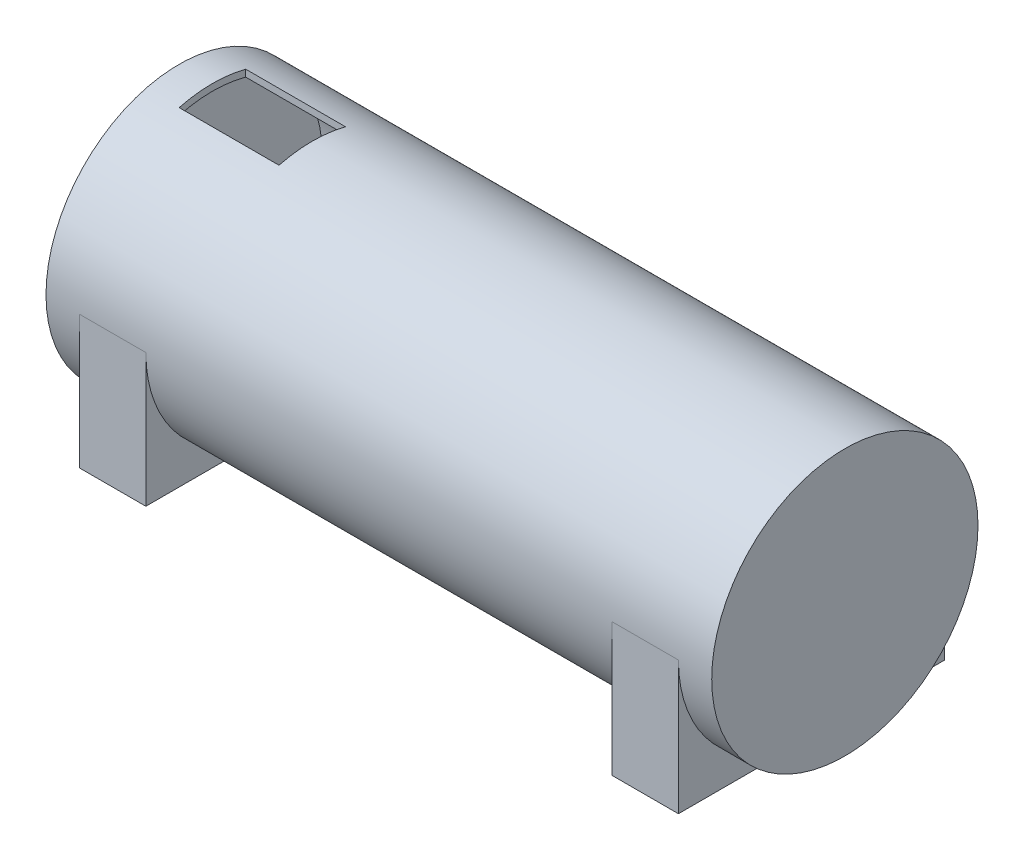
ISO-10303-21;
HEADER;
FILE_DESCRIPTION(('STEP AP214'),'2;1');
FILE_NAME('part.step','',(''),(''),'','','');
FILE_SCHEMA(('AUTOMOTIVE_DESIGN { 1 0 10303 214 1 1 1 1 }'));
ENDSEC;
DATA;
#1=APPLICATION_CONTEXT('core data for automotive mechanical design processes');
#2=APPLICATION_PROTOCOL_DEFINITION('international standard','automotive_design',2000,#1);
#3=PRODUCT_CONTEXT('',#1,'mechanical');
#4=PRODUCT('Part','Part','',(#3));
#5=PRODUCT_RELATED_PRODUCT_CATEGORY('part','',(#4));
#6=PRODUCT_DEFINITION_FORMATION('','',#4);
#7=PRODUCT_DEFINITION_CONTEXT('part definition',#1,'design');
#8=PRODUCT_DEFINITION('design','',#6,#7);
#9=PRODUCT_DEFINITION_SHAPE('','',#8);
#10=(LENGTH_UNIT() NAMED_UNIT(*) SI_UNIT(.MILLI.,.METRE.));
#11=(NAMED_UNIT(*) PLANE_ANGLE_UNIT() SI_UNIT($,.RADIAN.));
#12=(NAMED_UNIT(*) SI_UNIT($,.STERADIAN.) SOLID_ANGLE_UNIT());
#13=UNCERTAINTY_MEASURE_WITH_UNIT(LENGTH_MEASURE(1.E-05),#10,'distance_accuracy_value','');
#14=(GEOMETRIC_REPRESENTATION_CONTEXT(3) GLOBAL_UNCERTAINTY_ASSIGNED_CONTEXT((#13)) GLOBAL_UNIT_ASSIGNED_CONTEXT((#10,
#11,#12)) REPRESENTATION_CONTEXT('',''));
#15=CARTESIAN_POINT('',(0.,0.,0.));
#16=DIRECTION('',(0.,0.,1.));
#17=DIRECTION('',(1.,0.,0.));
#18=AXIS2_PLACEMENT_3D('',#15,#16,#17);
#19=CARTESIAN_POINT('',(-100.,0.,0.));
#20=DIRECTION('',(-1.,0.,0.));
#21=DIRECTION('',(0.,0.,1.));
#22=AXIS2_PLACEMENT_3D('',#19,#20,#21);
#23=PLANE('',#22);
#24=CARTESIAN_POINT('',(-100.,0.,0.));
#25=DIRECTION('',(1.,0.,0.));
#26=DIRECTION('',(0.,0.,-1.));
#27=AXIS2_PLACEMENT_3D('',#24,#25,#26);
#28=CIRCLE('',#27,40.);
#29=CARTESIAN_POINT('',(-100.,0.,-40.));
#30=VERTEX_POINT('',#29);
#31=EDGE_CURVE('E306',#30,#30,#28,.T.);
#32=ORIENTED_EDGE('',*,*,#31,.F.);
#33=EDGE_LOOP('',(#32));
#34=FACE_BOUND('',#33,.T.);
#35=ADVANCED_FACE('F47',(#34),#23,.T.);
#36=CARTESIAN_POINT('',(100.,0.,0.));
#37=DIRECTION('',(1.,0.,0.));
#38=DIRECTION('',(0.,0.,-1.));
#39=AXIS2_PLACEMENT_3D('',#36,#37,#38);
#40=CYLINDRICAL_SURFACE('',#39,40.);
#41=CARTESIAN_POINT('',(-90.,0.,0.));
#42=DIRECTION('',(1.,0.,0.));
#43=DIRECTION('',(0.,0.,-1.));
#44=AXIS2_PLACEMENT_3D('',#41,#42,#43);
#45=CIRCLE('',#44,40.);
#46=CARTESIAN_POINT('',(-90.,0.,40.));
#47=VERTEX_POINT('',#46);
#48=CARTESIAN_POINT('',(-90.,-40.,0.));
#49=VERTEX_POINT('',#48);
#50=EDGE_CURVE('E62',#47,#49,#45,.T.);
#51=ORIENTED_EDGE('',*,*,#50,.F.);
#52=DIRECTION('',(1.,0.,0.));
#53=VECTOR('',#52,1.);
#54=CARTESIAN_POINT('',(-90.,0.,40.));
#55=LINE('',#54,#53);
#56=CARTESIAN_POINT('',(-70.,0.,40.));
#57=VERTEX_POINT('',#56);
#58=EDGE_CURVE('E66',#47,#57,#55,.T.);
#59=ORIENTED_EDGE('',*,*,#58,.T.);
#60=CARTESIAN_POINT('',(-70.,0.,0.));
#61=DIRECTION('',(1.,0.,0.));
#62=DIRECTION('',(0.,0.,-1.));
#63=AXIS2_PLACEMENT_3D('',#60,#61,#62);
#64=CIRCLE('',#63,40.);
#65=CARTESIAN_POINT('',(-70.,-40.,0.));
#66=VERTEX_POINT('',#65);
#67=EDGE_CURVE('E175',#57,#66,#64,.T.);
#68=ORIENTED_EDGE('',*,*,#67,.T.);
#69=CARTESIAN_POINT('',(-70.,0.,0.));
#70=DIRECTION('',(-1.,0.,0.));
#71=DIRECTION('',(0.,0.,1.));
#72=AXIS2_PLACEMENT_3D('',#69,#70,#71);
#73=CIRCLE('',#72,40.);
#74=CARTESIAN_POINT('',(-70.,0.,-40.));
#75=VERTEX_POINT('',#74);
#76=EDGE_CURVE('E160',#75,#66,#73,.T.);
#77=ORIENTED_EDGE('',*,*,#76,.F.);
#78=DIRECTION('',(1.,0.,0.));
#79=VECTOR('',#78,1.);
#80=CARTESIAN_POINT('',(-90.,0.,-40.));
#81=LINE('',#80,#79);
#82=CARTESIAN_POINT('',(-90.,0.,-40.));
#83=VERTEX_POINT('',#82);
#84=EDGE_CURVE('E204',#83,#75,#81,.T.);
#85=ORIENTED_EDGE('',*,*,#84,.F.);
#86=CARTESIAN_POINT('',(-90.,0.,0.));
#87=DIRECTION('',(-1.,0.,0.));
#88=DIRECTION('',(0.,0.,1.));
#89=AXIS2_PLACEMENT_3D('',#86,#87,#88);
#90=CIRCLE('',#89,40.);
#91=EDGE_CURVE('E183',#83,#49,#90,.T.);
#92=ORIENTED_EDGE('',*,*,#91,.T.);
#93=EDGE_LOOP('',(#51,#59,#68,#77,#85,#92));
#94=FACE_BOUND('',#93,.T.);
#95=CARTESIAN_POINT('',(90.,0.,0.));
#96=DIRECTION('',(-1.,0.,0.));
#97=DIRECTION('',(0.,0.,1.));
#98=AXIS2_PLACEMENT_3D('',#95,#96,#97);
#99=CIRCLE('',#98,40.);
#100=CARTESIAN_POINT('',(90.,0.,-40.));
#101=VERTEX_POINT('',#100);
#102=CARTESIAN_POINT('',(90.,-40.,0.));
#103=VERTEX_POINT('',#102);
#104=EDGE_CURVE('E209',#101,#103,#99,.T.);
#105=ORIENTED_EDGE('',*,*,#104,.F.);
#106=DIRECTION('',(-1.,0.,0.));
#107=VECTOR('',#106,1.);
#108=CARTESIAN_POINT('',(90.,0.,-40.));
#109=LINE('',#108,#107);
#110=CARTESIAN_POINT('',(70.,0.,-40.));
#111=VERTEX_POINT('',#110);
#112=EDGE_CURVE('E222',#101,#111,#109,.T.);
#113=ORIENTED_EDGE('',*,*,#112,.T.);
#114=CARTESIAN_POINT('',(70.,0.,0.));
#115=DIRECTION('',(-1.,0.,0.));
#116=DIRECTION('',(0.,0.,1.));
#117=AXIS2_PLACEMENT_3D('',#114,#115,#116);
#118=CIRCLE('',#117,40.);
#119=CARTESIAN_POINT('',(70.,-40.,0.));
#120=VERTEX_POINT('',#119);
#121=EDGE_CURVE('E208',#111,#120,#118,.T.);
#122=ORIENTED_EDGE('',*,*,#121,.T.);
#123=CARTESIAN_POINT('',(70.,0.,0.));
#124=DIRECTION('',(1.,0.,0.));
#125=DIRECTION('',(0.,0.,-1.));
#126=AXIS2_PLACEMENT_3D('',#123,#124,#125);
#127=CIRCLE('',#126,40.);
#128=CARTESIAN_POINT('',(70.,0.,40.));
#129=VERTEX_POINT('',#128);
#130=EDGE_CURVE('E238',#129,#120,#127,.T.);
#131=ORIENTED_EDGE('',*,*,#130,.F.);
#132=DIRECTION('',(-1.,0.,0.));
#133=VECTOR('',#132,1.);
#134=CARTESIAN_POINT('',(90.,0.,40.));
#135=LINE('',#134,#133);
#136=CARTESIAN_POINT('',(90.,0.,40.));
#137=VERTEX_POINT('',#136);
#138=EDGE_CURVE('E262',#137,#129,#135,.T.);
#139=ORIENTED_EDGE('',*,*,#138,.F.);
#140=CARTESIAN_POINT('',(90.,0.,0.));
#141=DIRECTION('',(1.,0.,0.));
#142=DIRECTION('',(0.,0.,-1.));
#143=AXIS2_PLACEMENT_3D('',#140,#141,#142);
#144=CIRCLE('',#143,40.);
#145=EDGE_CURVE('E239',#137,#103,#144,.T.);
#146=ORIENTED_EDGE('',*,*,#145,.T.);
#147=EDGE_LOOP('',(#105,#113,#122,#131,#139,#146));
#148=FACE_BOUND('',#147,.T.);
#149=CARTESIAN_POINT('',(-90.,0.,0.));
#150=DIRECTION('',(-1.,0.,0.));
#151=DIRECTION('',(0.,0.,1.));
#152=AXIS2_PLACEMENT_3D('',#149,#150,#151);
#153=CIRCLE('',#152,40.);
#154=CARTESIAN_POINT('',(-90.,38.7298334620742,-10.));
#155=VERTEX_POINT('',#154);
#156=CARTESIAN_POINT('',(-90.,38.7298334620742,10.));
#157=VERTEX_POINT('',#156);
#158=EDGE_CURVE('E285',#155,#157,#153,.F.);
#159=ORIENTED_EDGE('',*,*,#158,.F.);
#160=DIRECTION('',(1.,0.,0.));
#161=VECTOR('',#160,1.);
#162=CARTESIAN_POINT('',(100.,38.7298334620742,-10.));
#163=LINE('',#162,#161);
#164=CARTESIAN_POINT('',(-60.,38.7298334620742,-10.));
#165=VERTEX_POINT('',#164);
#166=EDGE_CURVE('E271',#165,#155,#163,.F.);
#167=ORIENTED_EDGE('',*,*,#166,.F.);
#168=CARTESIAN_POINT('',(-60.,0.,0.));
#169=DIRECTION('',(1.,0.,0.));
#170=DIRECTION('',(0.,0.,-1.));
#171=AXIS2_PLACEMENT_3D('',#168,#169,#170);
#172=CIRCLE('',#171,40.);
#173=CARTESIAN_POINT('',(-60.,38.7298334620742,10.));
#174=VERTEX_POINT('',#173);
#175=EDGE_CURVE('E291',#174,#165,#172,.F.);
#176=ORIENTED_EDGE('',*,*,#175,.F.);
#177=DIRECTION('',(1.,0.,0.));
#178=VECTOR('',#177,1.);
#179=CARTESIAN_POINT('',(100.,38.7298334620742,10.));
#180=LINE('',#179,#178);
#181=EDGE_CURVE('E288',#157,#174,#180,.T.);
#182=ORIENTED_EDGE('',*,*,#181,.F.);
#183=EDGE_LOOP('',(#159,#167,#176,#182));
#184=FACE_BOUND('',#183,.T.);
#185=ORIENTED_EDGE('',*,*,#31,.T.);
#186=EDGE_LOOP('',(#185));
#187=FACE_BOUND('',#186,.T.);
#188=CARTESIAN_POINT('',(100.,0.,0.));
#189=DIRECTION('',(1.,0.,0.));
#190=DIRECTION('',(0.,0.,-1.));
#191=AXIS2_PLACEMENT_3D('',#188,#189,#190);
#192=CIRCLE('',#191,40.);
#193=CARTESIAN_POINT('',(100.,0.,-40.));
#194=VERTEX_POINT('',#193);
#195=EDGE_CURVE('E299',#194,#194,#192,.T.);
#196=ORIENTED_EDGE('',*,*,#195,.F.);
#197=EDGE_LOOP('',(#196));
#198=FACE_BOUND('',#197,.T.);
#199=ADVANCED_FACE('F340',(#94,#148,#184,#187,#198),#40,.T.);
#200=CARTESIAN_POINT('',(100.,40.,0.));
#201=DIRECTION('',(1.,0.,0.));
#202=DIRECTION('',(0.,0.,-1.));
#203=AXIS2_PLACEMENT_3D('',#200,#201,#202);
#204=PLANE('',#203);
#205=ORIENTED_EDGE('',*,*,#195,.T.);
#206=EDGE_LOOP('',(#205));
#207=FACE_BOUND('',#206,.T.);
#208=ADVANCED_FACE('F343',(#207),#204,.T.);
#209=CARTESIAN_POINT('',(-60.,30.,-10.));
#210=DIRECTION('',(1.,0.,0.));
#211=DIRECTION('',(0.,0.,-1.));
#212=AXIS2_PLACEMENT_3D('',#209,#210,#211);
#213=PLANE('',#212);
#214=ORIENTED_EDGE('',*,*,#175,.T.);
#215=DIRECTION('',(0.,1.,0.));
#216=VECTOR('',#215,1.);
#217=CARTESIAN_POINT('',(-60.,30.,-10.));
#218=LINE('',#217,#216);
#219=CARTESIAN_POINT('',(-60.,36.6606055596467,-10.));
#220=VERTEX_POINT('',#219);
#221=EDGE_CURVE('E266',#220,#165,#218,.T.);
#222=ORIENTED_EDGE('',*,*,#221,.F.);
#223=CARTESIAN_POINT('',(-60.,0.,0.));
#224=DIRECTION('',(1.,0.,0.));
#225=DIRECTION('',(0.,0.,-1.));
#226=AXIS2_PLACEMENT_3D('',#223,#224,#225);
#227=CIRCLE('',#226,38.);
#228=CARTESIAN_POINT('',(-60.,36.6606055596467,10.));
#229=VERTEX_POINT('',#228);
#230=EDGE_CURVE('E11',#220,#229,#227,.T.);
#231=ORIENTED_EDGE('',*,*,#230,.T.);
#232=DIRECTION('',(0.,1.,0.));
#233=VECTOR('',#232,1.);
#234=CARTESIAN_POINT('',(-60.,30.,10.));
#235=LINE('',#234,#233);
#236=EDGE_CURVE('E267',#229,#174,#235,.T.);
#237=ORIENTED_EDGE('',*,*,#236,.T.);
#238=EDGE_LOOP('',(#214,#222,#231,#237));
#239=FACE_BOUND('',#238,.T.);
#240=ADVANCED_FACE('F337',(#239),#213,.F.);
#241=CARTESIAN_POINT('',(-90.,30.,10.));
#242=DIRECTION('',(0.,0.,1.));
#243=DIRECTION('',(1.,0.,0.));
#244=AXIS2_PLACEMENT_3D('',#241,#242,#243);
#245=PLANE('',#244);
#246=ORIENTED_EDGE('',*,*,#181,.T.);
#247=ORIENTED_EDGE('',*,*,#236,.F.);
#248=DIRECTION('',(-1.,0.,0.));
#249=VECTOR('',#248,1.);
#250=CARTESIAN_POINT('',(95.,36.6606055596467,10.));
#251=LINE('',#250,#249);
#252=CARTESIAN_POINT('',(-90.,36.6606055596467,10.));
#253=VERTEX_POINT('',#252);
#254=EDGE_CURVE('E55',#229,#253,#251,.T.);
#255=ORIENTED_EDGE('',*,*,#254,.T.);
#256=DIRECTION('',(0.,1.,0.));
#257=VECTOR('',#256,1.);
#258=CARTESIAN_POINT('',(-90.,30.,10.));
#259=LINE('',#258,#257);
#260=EDGE_CURVE('E272',#253,#157,#259,.T.);
#261=ORIENTED_EDGE('',*,*,#260,.T.);
#262=EDGE_LOOP('',(#246,#247,#255,#261));
#263=FACE_BOUND('',#262,.T.);
#264=ADVANCED_FACE('F321',(#263),#245,.F.);
#265=CARTESIAN_POINT('',(-90.,30.,-10.));
#266=DIRECTION('',(-1.,0.,0.));
#267=DIRECTION('',(0.,0.,1.));
#268=AXIS2_PLACEMENT_3D('',#265,#266,#267);
#269=PLANE('',#268);
#270=ORIENTED_EDGE('',*,*,#158,.T.);
#271=ORIENTED_EDGE('',*,*,#260,.F.);
#272=CARTESIAN_POINT('',(-90.,0.,0.));
#273=DIRECTION('',(-1.,0.,0.));
#274=DIRECTION('',(0.,0.,1.));
#275=AXIS2_PLACEMENT_3D('',#272,#273,#274);
#276=CIRCLE('',#275,38.);
#277=CARTESIAN_POINT('',(-90.,36.6606055596467,-10.));
#278=VERTEX_POINT('',#277);
#279=EDGE_CURVE('E313',#253,#278,#276,.T.);
#280=ORIENTED_EDGE('',*,*,#279,.T.);
#281=DIRECTION('',(0.,1.,0.));
#282=VECTOR('',#281,1.);
#283=CARTESIAN_POINT('',(-90.,30.,-10.));
#284=LINE('',#283,#282);
#285=EDGE_CURVE('E276',#278,#155,#284,.T.);
#286=ORIENTED_EDGE('',*,*,#285,.T.);
#287=EDGE_LOOP('',(#270,#271,#280,#286));
#288=FACE_BOUND('',#287,.T.);
#289=ADVANCED_FACE('F327',(#288),#269,.F.);
#290=CARTESIAN_POINT('',(-90.,30.,-10.));
#291=DIRECTION('',(0.,0.,-1.));
#292=DIRECTION('',(-1.,0.,0.));
#293=AXIS2_PLACEMENT_3D('',#290,#291,#292);
#294=PLANE('',#293);
#295=ORIENTED_EDGE('',*,*,#166,.T.);
#296=ORIENTED_EDGE('',*,*,#285,.F.);
#297=DIRECTION('',(-1.,0.,0.));
#298=VECTOR('',#297,1.);
#299=CARTESIAN_POINT('',(95.,36.6606055596467,-10.));
#300=LINE('',#299,#298);
#301=EDGE_CURVE('E310',#278,#220,#300,.F.);
#302=ORIENTED_EDGE('',*,*,#301,.T.);
#303=ORIENTED_EDGE('',*,*,#221,.T.);
#304=EDGE_LOOP('',(#295,#296,#302,#303));
#305=FACE_BOUND('',#304,.T.);
#306=ADVANCED_FACE('F334',(#305),#294,.F.);
#307=CARTESIAN_POINT('',(95.,0.,0.));
#308=DIRECTION('',(-1.,0.,0.));
#309=DIRECTION('',(0.,0.,1.));
#310=AXIS2_PLACEMENT_3D('',#307,#308,#309);
#311=CYLINDRICAL_SURFACE('',#310,38.);
#312=ORIENTED_EDGE('',*,*,#230,.F.);
#313=ORIENTED_EDGE('',*,*,#301,.F.);
#314=ORIENTED_EDGE('',*,*,#279,.F.);
#315=ORIENTED_EDGE('',*,*,#254,.F.);
#316=EDGE_LOOP('',(#312,#313,#314,#315));
#317=FACE_BOUND('',#316,.T.);
#318=CARTESIAN_POINT('',(95.,0.,0.));
#319=DIRECTION('',(1.,0.,0.));
#320=DIRECTION('',(0.,0.,-1.));
#321=AXIS2_PLACEMENT_3D('',#318,#319,#320);
#322=CIRCLE('',#321,38.);
#323=CARTESIAN_POINT('',(95.,0.,-38.));
#324=VERTEX_POINT('',#323);
#325=EDGE_CURVE('E295',#324,#324,#322,.T.);
#326=ORIENTED_EDGE('',*,*,#325,.T.);
#327=EDGE_LOOP('',(#326));
#328=FACE_BOUND('',#327,.T.);
#329=CARTESIAN_POINT('',(-95.,0.,0.));
#330=DIRECTION('',(1.,0.,0.));
#331=DIRECTION('',(0.,0.,-1.));
#332=AXIS2_PLACEMENT_3D('',#329,#330,#331);
#333=CIRCLE('',#332,38.);
#334=CARTESIAN_POINT('',(-95.,0.,-38.));
#335=VERTEX_POINT('',#334);
#336=EDGE_CURVE('E294',#335,#335,#333,.T.);
#337=ORIENTED_EDGE('',*,*,#336,.F.);
#338=EDGE_LOOP('',(#337));
#339=FACE_BOUND('',#338,.T.);
#340=ADVANCED_FACE('F330',(#317,#328,#339),#311,.F.);
#341=CARTESIAN_POINT('',(95.,0.,0.));
#342=DIRECTION('',(1.,0.,0.));
#343=DIRECTION('',(0.,0.,-1.));
#344=AXIS2_PLACEMENT_3D('',#341,#342,#343);
#345=PLANE('',#344);
#346=ORIENTED_EDGE('',*,*,#325,.F.);
#347=EDGE_LOOP('',(#346));
#348=FACE_BOUND('',#347,.T.);
#349=ADVANCED_FACE('F557',(#348),#345,.F.);
#350=CARTESIAN_POINT('',(-95.,0.,0.));
#351=DIRECTION('',(1.,0.,0.));
#352=DIRECTION('',(0.,0.,-1.));
#353=AXIS2_PLACEMENT_3D('',#350,#351,#352);
#354=PLANE('',#353);
#355=ORIENTED_EDGE('',*,*,#336,.T.);
#356=EDGE_LOOP('',(#355));
#357=FACE_BOUND('',#356,.T.);
#358=ADVANCED_FACE('F517',(#357),#354,.T.);
#359=CARTESIAN_POINT('',(90.,0.,40.));
#360=DIRECTION('',(0.,0.,-1.));
#361=DIRECTION('',(-1.,0.,0.));
#362=AXIS2_PLACEMENT_3D('',#359,#360,#361);
#363=PLANE('',#362);
#364=DIRECTION('',(0.,-1.,0.));
#365=VECTOR('',#364,1.);
#366=CARTESIAN_POINT('',(70.,0.,40.));
#367=LINE('',#366,#365);
#368=CARTESIAN_POINT('',(70.,-40.,40.));
#369=VERTEX_POINT('',#368);
#370=EDGE_CURVE('E253',#129,#369,#367,.T.);
#371=ORIENTED_EDGE('',*,*,#370,.T.);
#372=DIRECTION('',(-1.,0.,0.));
#373=VECTOR('',#372,1.);
#374=CARTESIAN_POINT('',(90.,-40.,40.));
#375=LINE('',#374,#373);
#376=CARTESIAN_POINT('',(90.,-40.,40.));
#377=VERTEX_POINT('',#376);
#378=EDGE_CURVE('E250',#377,#369,#375,.T.);
#379=ORIENTED_EDGE('',*,*,#378,.F.);
#380=DIRECTION('',(0.,-1.,0.));
#381=VECTOR('',#380,1.);
#382=CARTESIAN_POINT('',(90.,0.,40.));
#383=LINE('',#382,#381);
#384=EDGE_CURVE('E243',#137,#377,#383,.T.);
#385=ORIENTED_EDGE('',*,*,#384,.F.);
#386=ORIENTED_EDGE('',*,*,#138,.T.);
#387=EDGE_LOOP('',(#371,#379,#385,#386));
#388=FACE_BOUND('',#387,.T.);
#389=ADVANCED_FACE('F508',(#388),#363,.F.);
#390=CARTESIAN_POINT('',(90.,-40.,0.));
#391=DIRECTION('',(0.,1.,0.));
#392=DIRECTION('',(0.,0.,1.));
#393=AXIS2_PLACEMENT_3D('',#390,#391,#392);
#394=PLANE('',#393);
#395=DIRECTION('',(0.,0.,-1.));
#396=VECTOR('',#395,1.);
#397=CARTESIAN_POINT('',(70.,-40.,0.));
#398=LINE('',#397,#396);
#399=EDGE_CURVE('E244',#369,#120,#398,.T.);
#400=ORIENTED_EDGE('',*,*,#399,.T.);
#401=DIRECTION('',(0.,0.,1.));
#402=VECTOR('',#401,1.);
#403=CARTESIAN_POINT('',(70.,-40.,0.));
#404=LINE('',#403,#402);
#405=CARTESIAN_POINT('',(70.,-40.,-40.));
#406=VERTEX_POINT('',#405);
#407=EDGE_CURVE('E226',#406,#120,#404,.T.);
#408=ORIENTED_EDGE('',*,*,#407,.F.);
#409=DIRECTION('',(-1.,0.,0.));
#410=VECTOR('',#409,1.);
#411=CARTESIAN_POINT('',(90.,-40.,-40.));
#412=LINE('',#411,#410);
#413=CARTESIAN_POINT('',(90.,-40.,-40.));
#414=VERTEX_POINT('',#413);
#415=EDGE_CURVE('E235',#414,#406,#412,.T.);
#416=ORIENTED_EDGE('',*,*,#415,.F.);
#417=DIRECTION('',(0.,0.,1.));
#418=VECTOR('',#417,1.);
#419=CARTESIAN_POINT('',(90.,-40.,0.));
#420=LINE('',#419,#418);
#421=EDGE_CURVE('E213',#414,#103,#420,.T.);
#422=ORIENTED_EDGE('',*,*,#421,.T.);
#423=DIRECTION('',(0.,0.,-1.));
#424=VECTOR('',#423,1.);
#425=CARTESIAN_POINT('',(90.,-40.,0.));
#426=LINE('',#425,#424);
#427=EDGE_CURVE('E247',#377,#103,#426,.T.);
#428=ORIENTED_EDGE('',*,*,#427,.F.);
#429=ORIENTED_EDGE('',*,*,#378,.T.);
#430=EDGE_LOOP('',(#400,#408,#416,#422,#428,#429));
#431=FACE_BOUND('',#430,.T.);
#432=ADVANCED_FACE('F498',(#431),#394,.F.);
#433=CARTESIAN_POINT('',(90.,0.,0.));
#434=DIRECTION('',(1.,0.,0.));
#435=DIRECTION('',(0.,0.,-1.));
#436=AXIS2_PLACEMENT_3D('',#433,#434,#435);
#437=PLANE('',#436);
#438=ORIENTED_EDGE('',*,*,#145,.F.);
#439=ORIENTED_EDGE('',*,*,#384,.T.);
#440=ORIENTED_EDGE('',*,*,#427,.T.);
#441=EDGE_LOOP('',(#438,#439,#440));
#442=FACE_BOUND('',#441,.T.);
#443=ADVANCED_FACE('F488',(#442),#437,.T.);
#444=CARTESIAN_POINT('',(70.,0.,0.));
#445=DIRECTION('',(1.,0.,0.));
#446=DIRECTION('',(0.,0.,-1.));
#447=AXIS2_PLACEMENT_3D('',#444,#445,#446);
#448=PLANE('',#447);
#449=ORIENTED_EDGE('',*,*,#130,.T.);
#450=ORIENTED_EDGE('',*,*,#399,.F.);
#451=ORIENTED_EDGE('',*,*,#370,.F.);
#452=EDGE_LOOP('',(#449,#450,#451));
#453=FACE_BOUND('',#452,.T.);
#454=ADVANCED_FACE('F477',(#453),#448,.F.);
#455=CARTESIAN_POINT('',(90.,0.,-40.));
#456=DIRECTION('',(0.,0.,-1.));
#457=DIRECTION('',(-1.,0.,0.));
#458=AXIS2_PLACEMENT_3D('',#455,#456,#457);
#459=PLANE('',#458);
#460=DIRECTION('',(0.,-1.,0.));
#461=VECTOR('',#460,1.);
#462=CARTESIAN_POINT('',(70.,0.,-40.));
#463=LINE('',#462,#461);
#464=EDGE_CURVE('E214',#111,#406,#463,.T.);
#465=ORIENTED_EDGE('',*,*,#464,.F.);
#466=ORIENTED_EDGE('',*,*,#112,.F.);
#467=DIRECTION('',(0.,-1.,0.));
#468=VECTOR('',#467,1.);
#469=CARTESIAN_POINT('',(90.,0.,-40.));
#470=LINE('',#469,#468);
#471=EDGE_CURVE('E218',#101,#414,#470,.T.);
#472=ORIENTED_EDGE('',*,*,#471,.T.);
#473=ORIENTED_EDGE('',*,*,#415,.T.);
#474=EDGE_LOOP('',(#465,#466,#472,#473));
#475=FACE_BOUND('',#474,.T.);
#476=ADVANCED_FACE('F468',(#475),#459,.T.);
#477=CARTESIAN_POINT('',(90.,0.,0.));
#478=DIRECTION('',(1.,0.,0.));
#479=DIRECTION('',(0.,0.,1.));
#480=AXIS2_PLACEMENT_3D('',#477,#478,#479);
#481=PLANE('',#480);
#482=ORIENTED_EDGE('',*,*,#104,.T.);
#483=ORIENTED_EDGE('',*,*,#421,.F.);
#484=ORIENTED_EDGE('',*,*,#471,.F.);
#485=EDGE_LOOP('',(#482,#483,#484));
#486=FACE_BOUND('',#485,.T.);
#487=ADVANCED_FACE('F459',(#486),#481,.T.);
#488=CARTESIAN_POINT('',(70.,0.,0.));
#489=DIRECTION('',(1.,0.,0.));
#490=DIRECTION('',(0.,0.,1.));
#491=AXIS2_PLACEMENT_3D('',#488,#489,#490);
#492=PLANE('',#491);
#493=ORIENTED_EDGE('',*,*,#121,.F.);
#494=ORIENTED_EDGE('',*,*,#464,.T.);
#495=ORIENTED_EDGE('',*,*,#407,.T.);
#496=EDGE_LOOP('',(#493,#494,#495));
#497=FACE_BOUND('',#496,.T.);
#498=ADVANCED_FACE('F371',(#497),#492,.F.);
#499=CARTESIAN_POINT('',(-90.,0.,-40.));
#500=DIRECTION('',(0.,0.,1.));
#501=DIRECTION('',(1.,0.,0.));
#502=AXIS2_PLACEMENT_3D('',#499,#500,#501);
#503=PLANE('',#502);
#504=DIRECTION('',(0.,-1.,0.));
#505=VECTOR('',#504,1.);
#506=CARTESIAN_POINT('',(-70.,0.,-40.));
#507=LINE('',#506,#505);
#508=CARTESIAN_POINT('',(-70.,-40.,-40.));
#509=VERTEX_POINT('',#508);
#510=EDGE_CURVE('E196',#75,#509,#507,.T.);
#511=ORIENTED_EDGE('',*,*,#510,.T.);
#512=DIRECTION('',(1.,0.,0.));
#513=VECTOR('',#512,1.);
#514=CARTESIAN_POINT('',(-90.,-40.,-40.));
#515=LINE('',#514,#513);
#516=CARTESIAN_POINT('',(-90.,-40.,-40.));
#517=VERTEX_POINT('',#516);
#518=EDGE_CURVE('E193',#517,#509,#515,.T.);
#519=ORIENTED_EDGE('',*,*,#518,.F.);
#520=DIRECTION('',(0.,-1.,0.));
#521=VECTOR('',#520,1.);
#522=CARTESIAN_POINT('',(-90.,0.,-40.));
#523=LINE('',#522,#521);
#524=EDGE_CURVE('E186',#83,#517,#523,.T.);
#525=ORIENTED_EDGE('',*,*,#524,.F.);
#526=ORIENTED_EDGE('',*,*,#84,.T.);
#527=EDGE_LOOP('',(#511,#519,#525,#526));
#528=FACE_BOUND('',#527,.T.);
#529=ADVANCED_FACE('F376',(#528),#503,.F.);
#530=CARTESIAN_POINT('',(-90.,-40.,0.));
#531=DIRECTION('',(0.,1.,0.));
#532=DIRECTION('',(0.,0.,1.));
#533=AXIS2_PLACEMENT_3D('',#530,#531,#532);
#534=PLANE('',#533);
#535=DIRECTION('',(0.,0.,1.));
#536=VECTOR('',#535,1.);
#537=CARTESIAN_POINT('',(-70.,-40.,0.));
#538=LINE('',#537,#536);
#539=EDGE_CURVE('E187',#509,#66,#538,.T.);
#540=ORIENTED_EDGE('',*,*,#539,.T.);
#541=DIRECTION('',(0.,0.,-1.));
#542=VECTOR('',#541,1.);
#543=CARTESIAN_POINT('',(-70.,-40.,0.));
#544=LINE('',#543,#542);
#545=CARTESIAN_POINT('',(-70.,-40.,40.));
#546=VERTEX_POINT('',#545);
#547=EDGE_CURVE('E154',#546,#66,#544,.T.);
#548=ORIENTED_EDGE('',*,*,#547,.F.);
#549=DIRECTION('',(1.,0.,0.));
#550=VECTOR('',#549,1.);
#551=CARTESIAN_POINT('',(-90.,-40.,40.));
#552=LINE('',#551,#550);
#553=CARTESIAN_POINT('',(-90.,-40.,40.));
#554=VERTEX_POINT('',#553);
#555=EDGE_CURVE('E147',#554,#546,#552,.T.);
#556=ORIENTED_EDGE('',*,*,#555,.F.);
#557=DIRECTION('',(0.,0.,-1.));
#558=VECTOR('',#557,1.);
#559=CARTESIAN_POINT('',(-90.,-40.,0.));
#560=LINE('',#559,#558);
#561=EDGE_CURVE('E152',#554,#49,#560,.T.);
#562=ORIENTED_EDGE('',*,*,#561,.T.);
#563=DIRECTION('',(0.,0.,1.));
#564=VECTOR('',#563,1.);
#565=CARTESIAN_POINT('',(-90.,-40.,0.));
#566=LINE('',#565,#564);
#567=EDGE_CURVE('E190',#517,#49,#566,.T.);
#568=ORIENTED_EDGE('',*,*,#567,.F.);
#569=ORIENTED_EDGE('',*,*,#518,.T.);
#570=EDGE_LOOP('',(#540,#548,#556,#562,#568,#569));
#571=FACE_BOUND('',#570,.T.);
#572=ADVANCED_FACE('F150',(#571),#534,.F.);
#573=CARTESIAN_POINT('',(-90.,0.,0.));
#574=DIRECTION('',(-1.,0.,0.));
#575=DIRECTION('',(0.,0.,1.));
#576=AXIS2_PLACEMENT_3D('',#573,#574,#575);
#577=PLANE('',#576);
#578=ORIENTED_EDGE('',*,*,#91,.F.);
#579=ORIENTED_EDGE('',*,*,#524,.T.);
#580=ORIENTED_EDGE('',*,*,#567,.T.);
#581=EDGE_LOOP('',(#578,#579,#580));
#582=FACE_BOUND('',#581,.T.);
#583=ADVANCED_FACE('F392',(#582),#577,.T.);
#584=CARTESIAN_POINT('',(-70.,0.,0.));
#585=DIRECTION('',(-1.,0.,0.));
#586=DIRECTION('',(0.,0.,1.));
#587=AXIS2_PLACEMENT_3D('',#584,#585,#586);
#588=PLANE('',#587);
#589=ORIENTED_EDGE('',*,*,#76,.T.);
#590=ORIENTED_EDGE('',*,*,#539,.F.);
#591=ORIENTED_EDGE('',*,*,#510,.F.);
#592=EDGE_LOOP('',(#589,#590,#591));
#593=FACE_BOUND('',#592,.T.);
#594=ADVANCED_FACE('F401',(#593),#588,.F.);
#595=CARTESIAN_POINT('',(-90.,0.,40.));
#596=DIRECTION('',(0.,0.,1.));
#597=DIRECTION('',(1.,0.,0.));
#598=AXIS2_PLACEMENT_3D('',#595,#596,#597);
#599=PLANE('',#598);
#600=DIRECTION('',(0.,-1.,0.));
#601=VECTOR('',#600,1.);
#602=CARTESIAN_POINT('',(-70.,0.,40.));
#603=LINE('',#602,#601);
#604=EDGE_CURVE('E180',#57,#546,#603,.T.);
#605=ORIENTED_EDGE('',*,*,#604,.F.);
#606=ORIENTED_EDGE('',*,*,#58,.F.);
#607=DIRECTION('',(0.,-1.,0.));
#608=VECTOR('',#607,1.);
#609=CARTESIAN_POINT('',(-90.,0.,40.));
#610=LINE('',#609,#608);
#611=EDGE_CURVE('E165',#47,#554,#610,.T.);
#612=ORIENTED_EDGE('',*,*,#611,.T.);
#613=ORIENTED_EDGE('',*,*,#555,.T.);
#614=EDGE_LOOP('',(#605,#606,#612,#613));
#615=FACE_BOUND('',#614,.T.);
#616=ADVANCED_FACE('F168',(#615),#599,.T.);
#617=CARTESIAN_POINT('',(-90.,0.,0.));
#618=DIRECTION('',(-1.,0.,0.));
#619=DIRECTION('',(0.,0.,-1.));
#620=AXIS2_PLACEMENT_3D('',#617,#618,#619);
#621=PLANE('',#620);
#622=ORIENTED_EDGE('',*,*,#50,.T.);
#623=ORIENTED_EDGE('',*,*,#561,.F.);
#624=ORIENTED_EDGE('',*,*,#611,.F.);
#625=EDGE_LOOP('',(#622,#623,#624));
#626=FACE_BOUND('',#625,.T.);
#627=ADVANCED_FACE('F164',(#626),#621,.T.);
#628=CARTESIAN_POINT('',(-70.,0.,0.));
#629=DIRECTION('',(-1.,0.,0.));
#630=DIRECTION('',(0.,0.,-1.));
#631=AXIS2_PLACEMENT_3D('',#628,#629,#630);
#632=PLANE('',#631);
#633=ORIENTED_EDGE('',*,*,#67,.F.);
#634=ORIENTED_EDGE('',*,*,#604,.T.);
#635=ORIENTED_EDGE('',*,*,#547,.T.);
#636=EDGE_LOOP('',(#633,#634,#635));
#637=FACE_BOUND('',#636,.T.);
#638=ADVANCED_FACE('F431',(#637),#632,.F.);
#639=CLOSED_SHELL('',(#35,#199,#208,#240,#264,#289,#306,#340,#349,#358,#389,#432,#443,#454,#476,
#487,#498,#529,#572,#583,#594,#616,#627,#638));
#640=MANIFOLD_SOLID_BREP('B2',#639);
#641=ADVANCED_BREP_SHAPE_REPRESENTATION('',(#18,#640),#14);
#642=SHAPE_DEFINITION_REPRESENTATION(#9,#641);
ENDSEC;
END-ISO-10303-21;
